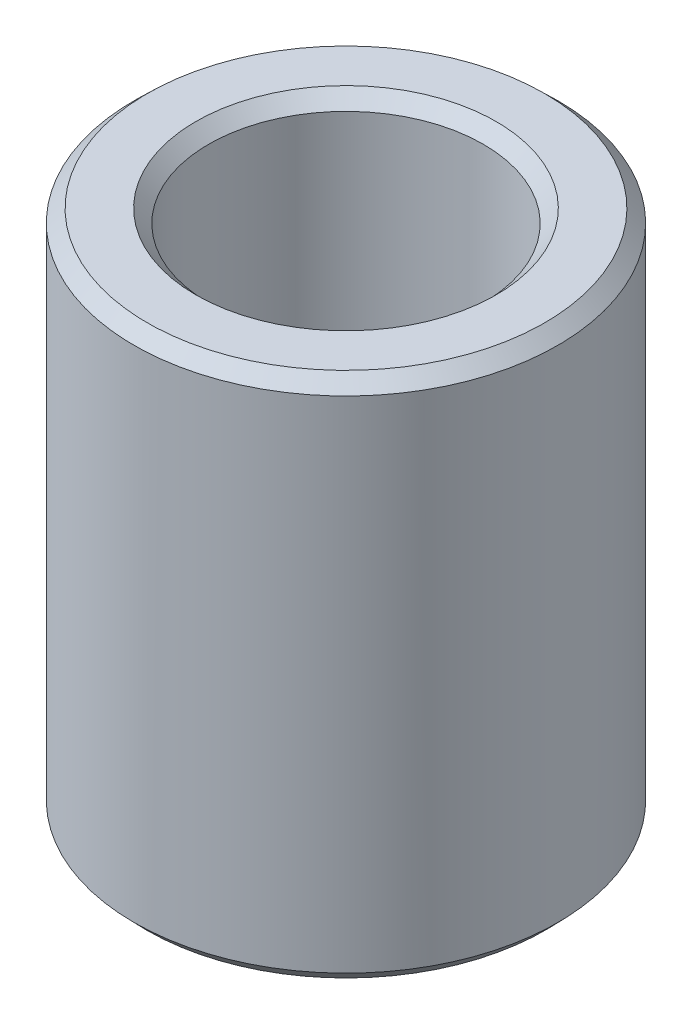
ISO-10303-21;
HEADER;
FILE_DESCRIPTION(('STEP AP214'),'2;1');
FILE_NAME('part.step','',(''),(''),'','','');
FILE_SCHEMA(('AUTOMOTIVE_DESIGN { 1 0 10303 214 1 1 1 1 }'));
ENDSEC;
DATA;
#1=APPLICATION_CONTEXT('core data for automotive mechanical design processes');
#2=APPLICATION_PROTOCOL_DEFINITION('international standard','automotive_design',2000,#1);
#3=PRODUCT_CONTEXT('',#1,'mechanical');
#4=PRODUCT('Part','Part','',(#3));
#5=PRODUCT_RELATED_PRODUCT_CATEGORY('part','',(#4));
#6=PRODUCT_DEFINITION_FORMATION('','',#4);
#7=PRODUCT_DEFINITION_CONTEXT('part definition',#1,'design');
#8=PRODUCT_DEFINITION('design','',#6,#7);
#9=PRODUCT_DEFINITION_SHAPE('','',#8);
#10=(LENGTH_UNIT() NAMED_UNIT(*) SI_UNIT(.MILLI.,.METRE.));
#11=(NAMED_UNIT(*) PLANE_ANGLE_UNIT() SI_UNIT($,.RADIAN.));
#12=(NAMED_UNIT(*) SI_UNIT($,.STERADIAN.) SOLID_ANGLE_UNIT());
#13=UNCERTAINTY_MEASURE_WITH_UNIT(LENGTH_MEASURE(1.E-05),#10,'distance_accuracy_value','');
#14=(GEOMETRIC_REPRESENTATION_CONTEXT(3) GLOBAL_UNCERTAINTY_ASSIGNED_CONTEXT((#13)) GLOBAL_UNIT_ASSIGNED_CONTEXT((#10,
#11,#12)) REPRESENTATION_CONTEXT('',''));
#15=CARTESIAN_POINT('',(0.,0.,0.));
#16=DIRECTION('',(0.,0.,1.));
#17=DIRECTION('',(1.,0.,0.));
#18=AXIS2_PLACEMENT_3D('',#15,#16,#17);
#19=CARTESIAN_POINT('',(0.,55.8443556922629,0.));
#20=DIRECTION('',(0.,-1.,0.));
#21=DIRECTION('',(0.,0.,-1.));
#22=AXIS2_PLACEMENT_3D('',#19,#20,#21);
#23=CYLINDRICAL_SURFACE('',#22,22.5);
#24=CARTESIAN_POINT('',(0.,1.40685708802177,0.));
#25=DIRECTION('',(0.,1.,0.));
#26=DIRECTION('',(0.,0.,1.));
#27=AXIS2_PLACEMENT_3D('',#24,#25,#26);
#28=CIRCLE('',#27,22.5);
#29=CARTESIAN_POINT('',(0.,1.40685708802177,22.5));
#30=VERTEX_POINT('',#29);
#31=EDGE_CURVE('E10',#30,#30,#28,.T.);
#32=ORIENTED_EDGE('',*,*,#31,.T.);
#33=EDGE_LOOP('',(#32));
#34=FACE_BOUND('',#33,.T.);
#35=CARTESIAN_POINT('',(0.,54.4802346893428,0.));
#36=DIRECTION('',(0.,1.,0.));
#37=DIRECTION('',(0.,0.,1.));
#38=AXIS2_PLACEMENT_3D('',#35,#36,#37);
#39=CIRCLE('',#38,22.5);
#40=CARTESIAN_POINT('',(0.,54.4802346893428,-22.5));
#41=VERTEX_POINT('',#40);
#42=EDGE_CURVE('E50',#41,#41,#39,.F.);
#43=ORIENTED_EDGE('',*,*,#42,.T.);
#44=EDGE_LOOP('',(#43));
#45=FACE_BOUND('',#44,.T.);
#46=ADVANCED_FACE('F39',(#34,#45),#23,.T.);
#47=CARTESIAN_POINT('',(0.,55.8443556922629,0.));
#48=DIRECTION('',(0.,1.,0.));
#49=DIRECTION('',(0.,0.,1.));
#50=AXIS2_PLACEMENT_3D('',#47,#48,#49);
#51=PLANE('',#50);
#52=CARTESIAN_POINT('',(0.,55.8443556922629,0.));
#53=DIRECTION('',(0.,1.,0.));
#54=DIRECTION('',(0.,0.,1.));
#55=AXIS2_PLACEMENT_3D('',#52,#53,#54);
#56=CIRCLE('',#55,15.9459392775636);
#57=CARTESIAN_POINT('',(0.,55.8443556922629,15.9459392775636));
#58=VERTEX_POINT('',#57);
#59=EDGE_CURVE('E58',#58,#58,#56,.F.);
#60=ORIENTED_EDGE('',*,*,#59,.T.);
#61=EDGE_LOOP('',(#60));
#62=FACE_BOUND('',#61,.T.);
#63=CARTESIAN_POINT('',(0.,55.8443556922629,0.));
#64=DIRECTION('',(0.,1.,0.));
#65=DIRECTION('',(0.,0.,1.));
#66=AXIS2_PLACEMENT_3D('',#63,#64,#65);
#67=CIRCLE('',#66,21.0931429119783);
#68=CARTESIAN_POINT('',(0.,55.8443556922629,-21.0931429119783));
#69=VERTEX_POINT('',#68);
#70=EDGE_CURVE('E61',#69,#69,#67,.T.);
#71=ORIENTED_EDGE('',*,*,#70,.T.);
#72=EDGE_LOOP('',(#71));
#73=FACE_BOUND('',#72,.T.);
#74=ADVANCED_FACE('F88',(#62,#73),#51,.T.);
#75=CARTESIAN_POINT('',(0.,0.,0.));
#76=DIRECTION('',(0.,1.,0.));
#77=DIRECTION('',(0.,0.,1.));
#78=AXIS2_PLACEMENT_3D('',#75,#76,#77);
#79=PLANE('',#78);
#80=CARTESIAN_POINT('',(0.,0.,0.));
#81=DIRECTION('',(0.,1.,0.));
#82=DIRECTION('',(0.,0.,1.));
#83=AXIS2_PLACEMENT_3D('',#80,#81,#82);
#84=CIRCLE('',#83,15.9886753626652);
#85=CARTESIAN_POINT('',(0.,0.,15.9886753626652));
#86=VERTEX_POINT('',#85);
#87=EDGE_CURVE('E51',#86,#86,#84,.T.);
#88=ORIENTED_EDGE('',*,*,#87,.T.);
#89=EDGE_LOOP('',(#88));
#90=FACE_BOUND('',#89,.T.);
#91=CARTESIAN_POINT('',(0.,0.,0.));
#92=DIRECTION('',(0.,1.,0.));
#93=DIRECTION('',(0.,0.,1.));
#94=AXIS2_PLACEMENT_3D('',#91,#92,#93);
#95=CIRCLE('',#94,21.1358789970799);
#96=CARTESIAN_POINT('',(0.,0.,21.1358789970799));
#97=VERTEX_POINT('',#96);
#98=EDGE_CURVE('E54',#97,#97,#95,.F.);
#99=ORIENTED_EDGE('',*,*,#98,.T.);
#100=EDGE_LOOP('',(#99));
#101=FACE_BOUND('',#100,.T.);
#102=ADVANCED_FACE('F83',(#90,#101),#79,.F.);
#103=CARTESIAN_POINT('',(0.,55.8443556922629,0.));
#104=DIRECTION('',(0.,-1.,0.));
#105=DIRECTION('',(0.,0.,-1.));
#106=AXIS2_PLACEMENT_3D('',#103,#104,#105);
#107=CYLINDRICAL_SURFACE('',#106,14.5818182746435);
#108=CARTESIAN_POINT('',(0.,54.4374986042411,0.));
#109=DIRECTION('',(0.,1.,0.));
#110=DIRECTION('',(0.,0.,1.));
#111=AXIS2_PLACEMENT_3D('',#108,#109,#110);
#112=CIRCLE('',#111,14.5818182746435);
#113=CARTESIAN_POINT('',(0.,54.4374986042411,14.5818182746435));
#114=VERTEX_POINT('',#113);
#115=EDGE_CURVE('E67',#114,#114,#112,.T.);
#116=ORIENTED_EDGE('',*,*,#115,.T.);
#117=EDGE_LOOP('',(#116));
#118=FACE_BOUND('',#117,.T.);
#119=CARTESIAN_POINT('',(0.,1.3641210029201,0.));
#120=DIRECTION('',(0.,1.,0.));
#121=DIRECTION('',(0.,0.,1.));
#122=AXIS2_PLACEMENT_3D('',#119,#120,#121);
#123=CIRCLE('',#122,14.5818182746435);
#124=CARTESIAN_POINT('',(0.,1.3641210029201,14.5818182746435));
#125=VERTEX_POINT('',#124);
#126=EDGE_CURVE('E69',#125,#125,#123,.F.);
#127=ORIENTED_EDGE('',*,*,#126,.T.);
#128=EDGE_LOOP('',(#127));
#129=FACE_BOUND('',#128,.T.);
#130=ADVANCED_FACE('F71',(#118,#129),#107,.F.);
#131=CARTESIAN_POINT('',(0.,54.4374986042411,0.));
#132=DIRECTION('',(0.,1.,0.));
#133=DIRECTION('',(0.,0.,1.));
#134=AXIS2_PLACEMENT_3D('',#131,#132,#133);
#135=CONICAL_SURFACE('',#134,14.5818182746435,0.769976642271567);
#136=ORIENTED_EDGE('',*,*,#59,.F.);
#137=EDGE_LOOP('',(#136));
#138=FACE_BOUND('',#137,.T.);
#139=ORIENTED_EDGE('',*,*,#115,.F.);
#140=EDGE_LOOP('',(#139));
#141=FACE_BOUND('',#140,.T.);
#142=ADVANCED_FACE('F77',(#138,#141),#135,.F.);
#143=CARTESIAN_POINT('',(0.,0.,0.));
#144=DIRECTION('',(0.,-1.,0.));
#145=DIRECTION('',(0.,0.,-1.));
#146=AXIS2_PLACEMENT_3D('',#143,#144,#145);
#147=CONICAL_SURFACE('',#146,15.9886753626652,0.800819684523328);
#148=ORIENTED_EDGE('',*,*,#126,.F.);
#149=EDGE_LOOP('',(#148));
#150=FACE_BOUND('',#149,.T.);
#151=ORIENTED_EDGE('',*,*,#87,.F.);
#152=EDGE_LOOP('',(#151));
#153=FACE_BOUND('',#152,.T.);
#154=ADVANCED_FACE('F73',(#150,#153),#147,.F.);
#155=CARTESIAN_POINT('',(0.,1.40685708802177,0.));
#156=DIRECTION('',(0.,1.,0.));
#157=DIRECTION('',(0.,0.,1.));
#158=AXIS2_PLACEMENT_3D('',#155,#156,#157);
#159=CONICAL_SURFACE('',#158,22.5,0.769976642271566);
#160=ORIENTED_EDGE('',*,*,#98,.F.);
#161=EDGE_LOOP('',(#160));
#162=FACE_BOUND('',#161,.T.);
#163=ORIENTED_EDGE('',*,*,#31,.F.);
#164=EDGE_LOOP('',(#163));
#165=FACE_BOUND('',#164,.T.);
#166=ADVANCED_FACE('F76',(#162,#165),#159,.T.);
#167=CARTESIAN_POINT('',(0.,55.8443556922629,0.));
#168=DIRECTION('',(0.,-1.,0.));
#169=DIRECTION('',(0.,0.,-1.));
#170=AXIS2_PLACEMENT_3D('',#167,#168,#169);
#171=CONICAL_SURFACE('',#170,21.0931429119783,0.800819684523331);
#172=CARTESIAN_POINT('',(0.,54.4802346893428,-22.5));
#173=CARTESIAN_POINT('',(0.,54.4944442831232,-22.4853452386664));
#174=CARTESIAN_POINT('',(0.,54.5086538769037,-22.4706904773329));
#175=CARTESIAN_POINT('',(0.,54.5370730644645,-22.4413809546658));
#176=CARTESIAN_POINT('',(0.,54.5512826582449,-22.4267261933322));
#177=CARTESIAN_POINT('',(0.,54.5797018458057,-22.3974166706651));
#178=CARTESIAN_POINT('',(0.,54.5939114395862,-22.3827619093315));
#179=CARTESIAN_POINT('',(0.,54.622330627147,-22.3534523866644));
#180=CARTESIAN_POINT('',(0.,54.6365402209274,-22.3387976253309));
#181=CARTESIAN_POINT('',(0.,54.6649594084882,-22.3094881026637));
#182=CARTESIAN_POINT('',(0.,54.6791690022687,-22.2948333413302));
#183=CARTESIAN_POINT('',(0.,54.7075881898295,-22.2655238186631));
#184=CARTESIAN_POINT('',(0.,54.7217977836099,-22.2508690573295));
#185=CARTESIAN_POINT('',(0.,54.7502169711707,-22.2215595346624));
#186=CARTESIAN_POINT('',(0.,54.7644265649512,-22.2069047733288));
#187=CARTESIAN_POINT('',(0.,54.792845752512,-22.1775952506617));
#188=CARTESIAN_POINT('',(0.,54.8070553462924,-22.1629404893281));
#189=CARTESIAN_POINT('',(0.,54.8354745338532,-22.133630966661));
#190=CARTESIAN_POINT('',(0.,54.8496841276337,-22.1189762053275));
#191=CARTESIAN_POINT('',(0.,54.8781033151945,-22.0896666826603));
#192=CARTESIAN_POINT('',(0.,54.8923129089749,-22.0750119213268));
#193=CARTESIAN_POINT('',(0.,54.9207320965358,-22.0457023986597));
#194=CARTESIAN_POINT('',(0.,54.9349416903162,-22.0310476373261));
#195=CARTESIAN_POINT('',(0.,54.963360877877,-22.001738114659));
#196=CARTESIAN_POINT('',(0.,54.9775704716574,-21.9870833533254));
#197=CARTESIAN_POINT('',(0.,55.0059896592183,-21.9577738306583));
#198=CARTESIAN_POINT('',(0.,55.0201992529987,-21.9431190693247));
#199=CARTESIAN_POINT('',(0.,55.0486184405595,-21.9138095466576));
#200=CARTESIAN_POINT('',(0.,55.0628280343399,-21.8991547853241));
#201=CARTESIAN_POINT('',(0.,55.0912472219008,-21.8698452626569));
#202=CARTESIAN_POINT('',(0.,55.1054568156812,-21.8551905013234));
#203=CARTESIAN_POINT('',(0.,55.133876003242,-21.8258809786563));
#204=CARTESIAN_POINT('',(0.,55.1480855970224,-21.8112262173227));
#205=CARTESIAN_POINT('',(0.,55.1765047845833,-21.7819166946556));
#206=CARTESIAN_POINT('',(0.,55.1907143783637,-21.767261933322));
#207=CARTESIAN_POINT('',(0.,55.2191335659245,-21.7379524106549));
#208=CARTESIAN_POINT('',(0.,55.2333431597049,-21.7232976493213));
#209=CARTESIAN_POINT('',(0.,55.2617623472658,-21.6939881266542));
#210=CARTESIAN_POINT('',(0.,55.2759719410462,-21.6793333653207));
#211=CARTESIAN_POINT('',(0.,55.304391128607,-21.6500238426535));
#212=CARTESIAN_POINT('',(0.,55.3186007223874,-21.63536908132));
#213=CARTESIAN_POINT('',(0.,55.3470199099483,-21.6060595586529));
#214=CARTESIAN_POINT('',(0.,55.3612295037287,-21.5914047973193));
#215=CARTESIAN_POINT('',(0.,55.3896486912895,-21.5620952746522));
#216=CARTESIAN_POINT('',(0.,55.4038582850699,-21.5474405133186));
#217=CARTESIAN_POINT('',(0.,55.4322774726308,-21.5181309906515));
#218=CARTESIAN_POINT('',(0.,55.4464870664112,-21.503476229318));
#219=CARTESIAN_POINT('',(0.,55.474906253972,-21.4741667066508));
#220=CARTESIAN_POINT('',(0.,55.4891158477525,-21.4595119453173));
#221=CARTESIAN_POINT('',(0.,55.5175350353133,-21.4302024226502));
#222=CARTESIAN_POINT('',(0.,55.5317446290937,-21.4155476613166));
#223=CARTESIAN_POINT('',(0.,55.5601638166545,-21.3862381386495));
#224=CARTESIAN_POINT('',(0.,55.574373410435,-21.3715833773159));
#225=CARTESIAN_POINT('',(0.,55.6027925979958,-21.3422738546488));
#226=CARTESIAN_POINT('',(0.,55.6170021917762,-21.3276190933152));
#227=CARTESIAN_POINT('',(0.,55.645421379337,-21.2983095706481));
#228=CARTESIAN_POINT('',(0.,55.6596309731175,-21.2836548093146));
#229=CARTESIAN_POINT('',(0.,55.6880501606783,-21.2543452866474));
#230=CARTESIAN_POINT('',(0.,55.7022597544587,-21.2396905253139));
#231=CARTESIAN_POINT('',(0.,55.7306789420195,-21.2103810026468));
#232=CARTESIAN_POINT('',(0.,55.7448885358,-21.1957262413132));
#233=CARTESIAN_POINT('',(0.,55.7733077233608,-21.1664167186461));
#234=CARTESIAN_POINT('',(0.,55.7875173171412,-21.1517619573125));
#235=CARTESIAN_POINT('',(0.,55.815936504702,-21.1224524346454));
#236=CARTESIAN_POINT('',(0.,55.8301460984825,-21.1077976733118));
#237=CARTESIAN_POINT('',(0.,55.8443556922629,-21.0931429119783));
#238=B_SPLINE_CURVE_WITH_KNOTS('',3,(#172,#173,#174,#175,#176,#177,#178,#179,#180,#181,#182,
#183,#184,#185,#186,#187,#188,#189,#190,#191,#192,#193,#194,#195,#196,#197,#198,#199,#200,#201,
#202,#203,#204,#205,#206,#207,#208,#209,#210,#211,#212,#213,#214,#215,#216,#217,#218,#219,#220,
#221,#222,#223,#224,#225,#226,#227,#228,#229,#230,#231,#232,#233,#234,#235,#236,#237),
.UNSPECIFIED.,.F.,.F.,(4,2,2,2,2,2,2,2,2,2,2,2,2,2,2,2,2,2,2,2,2,2,2,2,2,2,2,2,2,2,2,2,4),(0.,
0.0612378254539829,0.122475650907968,0.183713476361951,0.244951301815937,0.306189127269919,
0.367426952723902,0.428664778177888,0.489902603631871,0.551140429085856,0.612378254539839,
0.673616079993827,0.734853905447812,0.796091730901795,0.85732955635578,0.918567381809763,
0.979805207263746,1.04104303271773,1.10228085817171,1.1635186836257,1.22475650907968,
1.28599433453367,1.34723215998766,1.40846998544164,1.46970781089562,1.53094563634961,
1.59218346180359,1.65342128725758,1.71465911271156,1.77589693816554,1.83713476361953,
1.89837258907351,1.9596104145275),.UNSPECIFIED.);
#239=EDGE_CURVE('BSEAM45',#41,#69,#238,.T.);
#240=ORIENTED_EDGE('',*,*,#42,.F.);
#241=ORIENTED_EDGE('',*,*,#70,.F.);
#242=ORIENTED_EDGE('',*,*,#239,.T.);
#243=ORIENTED_EDGE('',*,*,#239,.F.);
#244=EDGE_LOOP('',(#240,#242,#241,#243));
#245=FACE_BOUND('',#244,.T.);
#246=ADVANCED_FACE('F45',(#245),#171,.T.);
#247=CLOSED_SHELL('',(#46,#74,#102,#130,#142,#154,#166,#246));
#248=MANIFOLD_SOLID_BREP('B2',#247);
#249=ADVANCED_BREP_SHAPE_REPRESENTATION('',(#18,#248),#14);
#250=SHAPE_DEFINITION_REPRESENTATION(#9,#249);
ENDSEC;
END-ISO-10303-21;
